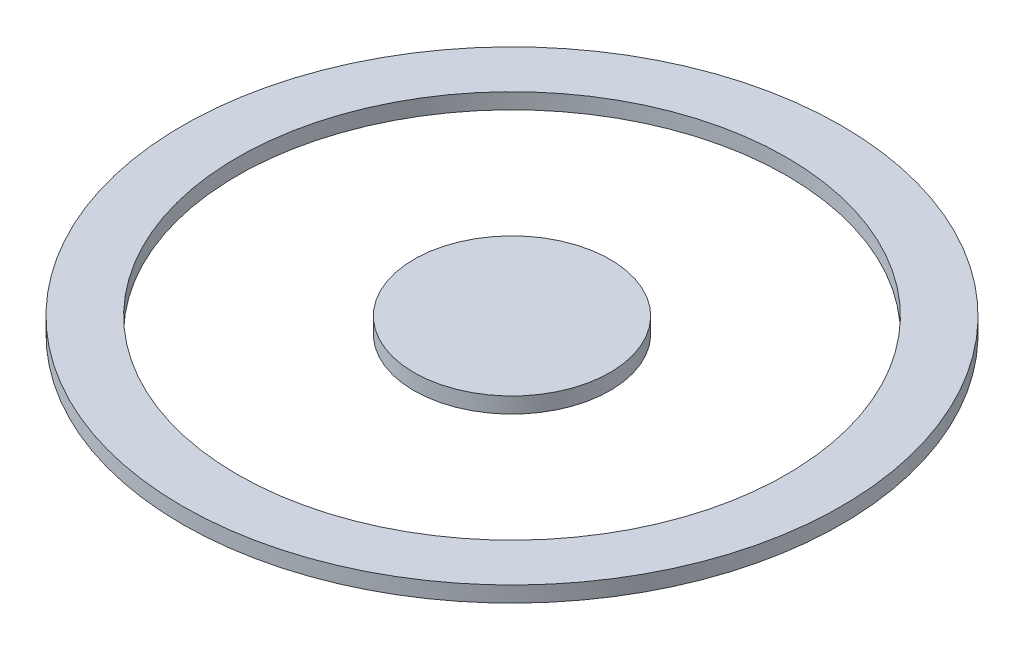
ISO-10303-21;
HEADER;
FILE_DESCRIPTION(('STEP AP214'),'2;1');
FILE_NAME('part.step','',(''),(''),'','','');
FILE_SCHEMA(('AUTOMOTIVE_DESIGN { 1 0 10303 214 1 1 1 1 }'));
ENDSEC;
DATA;
#1=APPLICATION_CONTEXT('core data for automotive mechanical design processes');
#2=APPLICATION_PROTOCOL_DEFINITION('international standard','automotive_design',2000,#1);
#3=PRODUCT_CONTEXT('',#1,'mechanical');
#4=PRODUCT('Part','Part','',(#3));
#5=PRODUCT_RELATED_PRODUCT_CATEGORY('part','',(#4));
#6=PRODUCT_DEFINITION_FORMATION('','',#4);
#7=PRODUCT_DEFINITION_CONTEXT('part definition',#1,'design');
#8=PRODUCT_DEFINITION('design','',#6,#7);
#9=PRODUCT_DEFINITION_SHAPE('','',#8);
#10=(LENGTH_UNIT() NAMED_UNIT(*) SI_UNIT(.MILLI.,.METRE.));
#11=(NAMED_UNIT(*) PLANE_ANGLE_UNIT() SI_UNIT($,.RADIAN.));
#12=(NAMED_UNIT(*) SI_UNIT($,.STERADIAN.) SOLID_ANGLE_UNIT());
#13=UNCERTAINTY_MEASURE_WITH_UNIT(LENGTH_MEASURE(1.E-05),#10,'distance_accuracy_value','');
#14=(GEOMETRIC_REPRESENTATION_CONTEXT(3) GLOBAL_UNCERTAINTY_ASSIGNED_CONTEXT((#13)) GLOBAL_UNIT_ASSIGNED_CONTEXT((#10,
#11,#12)) REPRESENTATION_CONTEXT('',''));
#15=CARTESIAN_POINT('',(0.,0.,0.));
#16=DIRECTION('',(0.,0.,1.));
#17=DIRECTION('',(1.,0.,0.));
#18=AXIS2_PLACEMENT_3D('',#15,#16,#17);
#19=CARTESIAN_POINT('',(0.,2.,0.));
#20=DIRECTION('',(0.,-1.,0.));
#21=DIRECTION('',(0.,0.,-1.));
#22=AXIS2_PLACEMENT_3D('',#19,#20,#21);
#23=CYLINDRICAL_SURFACE('',#22,42.);
#24=CARTESIAN_POINT('',(0.,2.,0.));
#25=DIRECTION('',(0.,1.,0.));
#26=DIRECTION('',(0.,0.,1.));
#27=AXIS2_PLACEMENT_3D('',#24,#25,#26);
#28=CIRCLE('',#27,42.);
#29=CARTESIAN_POINT('',(0.,2.,42.));
#30=VERTEX_POINT('',#29);
#31=EDGE_CURVE('E55',#30,#30,#28,.T.);
#32=ORIENTED_EDGE('',*,*,#31,.F.);
#33=EDGE_LOOP('',(#32));
#34=FACE_BOUND('',#33,.T.);
#35=CARTESIAN_POINT('',(0.,0.,0.));
#36=DIRECTION('',(0.,1.,0.));
#37=DIRECTION('',(0.,0.,1.));
#38=AXIS2_PLACEMENT_3D('',#35,#36,#37);
#39=CIRCLE('',#38,42.);
#40=CARTESIAN_POINT('',(0.,0.,42.));
#41=VERTEX_POINT('',#40);
#42=EDGE_CURVE('E59',#41,#41,#39,.T.);
#43=ORIENTED_EDGE('',*,*,#42,.T.);
#44=EDGE_LOOP('',(#43));
#45=FACE_BOUND('',#44,.T.);
#46=ADVANCED_FACE('F44',(#34,#45),#23,.T.);
#47=CARTESIAN_POINT('',(0.,2.,0.));
#48=DIRECTION('',(0.,1.,0.));
#49=DIRECTION('',(0.,0.,1.));
#50=AXIS2_PLACEMENT_3D('',#47,#48,#49);
#51=PLANE('',#50);
#52=CARTESIAN_POINT('',(0.,2.,0.));
#53=DIRECTION('',(0.,1.,0.));
#54=DIRECTION('',(0.,0.,1.));
#55=AXIS2_PLACEMENT_3D('',#52,#53,#54);
#56=CIRCLE('',#55,35.);
#57=CARTESIAN_POINT('',(0.,2.,35.));
#58=VERTEX_POINT('',#57);
#59=EDGE_CURVE('E11',#58,#58,#56,.T.);
#60=ORIENTED_EDGE('',*,*,#59,.F.);
#61=EDGE_LOOP('',(#60));
#62=FACE_BOUND('',#61,.T.);
#63=ORIENTED_EDGE('',*,*,#31,.T.);
#64=EDGE_LOOP('',(#63));
#65=FACE_BOUND('',#64,.T.);
#66=ADVANCED_FACE('F46',(#62,#65),#51,.T.);
#67=CARTESIAN_POINT('',(0.,0.,0.));
#68=DIRECTION('',(0.,1.,0.));
#69=DIRECTION('',(0.,0.,1.));
#70=AXIS2_PLACEMENT_3D('',#67,#68,#69);
#71=PLANE('',#70);
#72=CARTESIAN_POINT('',(0.,0.,0.));
#73=DIRECTION('',(0.,1.,0.));
#74=DIRECTION('',(0.,0.,1.));
#75=AXIS2_PLACEMENT_3D('',#72,#73,#74);
#76=CIRCLE('',#75,35.);
#77=CARTESIAN_POINT('',(0.,0.,35.));
#78=VERTEX_POINT('',#77);
#79=EDGE_CURVE('E48',#78,#78,#76,.T.);
#80=ORIENTED_EDGE('',*,*,#79,.T.);
#81=EDGE_LOOP('',(#80));
#82=FACE_BOUND('',#81,.T.);
#83=ORIENTED_EDGE('',*,*,#42,.F.);
#84=EDGE_LOOP('',(#83));
#85=FACE_BOUND('',#84,.T.);
#86=ADVANCED_FACE('F64',(#82,#85),#71,.F.);
#87=CARTESIAN_POINT('',(0.,0.,0.));
#88=DIRECTION('',(0.,1.,0.));
#89=DIRECTION('',(0.,0.,1.));
#90=AXIS2_PLACEMENT_3D('',#87,#88,#89);
#91=CYLINDRICAL_SURFACE('',#90,35.);
#92=ORIENTED_EDGE('',*,*,#79,.F.);
#93=EDGE_LOOP('',(#92));
#94=FACE_BOUND('',#93,.T.);
#95=ORIENTED_EDGE('',*,*,#59,.T.);
#96=EDGE_LOOP('',(#95));
#97=FACE_BOUND('',#96,.T.);
#98=ADVANCED_FACE('F66',(#94,#97),#91,.F.);
#99=CLOSED_SHELL('',(#46,#66,#86,#98));
#100=MANIFOLD_SOLID_BREP('B2',#99);
#101=CARTESIAN_POINT('',(0.,0.,0.));
#102=DIRECTION('',(0.,1.,0.));
#103=DIRECTION('',(0.,0.,1.));
#104=AXIS2_PLACEMENT_3D('',#101,#102,#103);
#105=PLANE('',#104);
#106=CARTESIAN_POINT('',(0.,0.,0.));
#107=DIRECTION('',(0.,1.,0.));
#108=DIRECTION('',(0.,0.,1.));
#109=AXIS2_PLACEMENT_3D('',#106,#107,#108);
#110=CIRCLE('',#109,12.5);
#111=CARTESIAN_POINT('',(0.,0.,12.5));
#112=VERTEX_POINT('',#111);
#113=EDGE_CURVE('E43',#112,#112,#110,.T.);
#114=ORIENTED_EDGE('',*,*,#113,.F.);
#115=EDGE_LOOP('',(#114));
#116=FACE_BOUND('',#115,.T.);
#117=ADVANCED_FACE('F113',(#116),#105,.F.);
#118=CARTESIAN_POINT('',(0.,0.,0.));
#119=DIRECTION('',(0.,1.,0.));
#120=DIRECTION('',(0.,0.,1.));
#121=AXIS2_PLACEMENT_3D('',#118,#119,#120);
#122=CYLINDRICAL_SURFACE('',#121,12.5);
#123=ORIENTED_EDGE('',*,*,#113,.T.);
#124=EDGE_LOOP('',(#123));
#125=FACE_BOUND('',#124,.T.);
#126=CARTESIAN_POINT('',(0.,2.,0.));
#127=DIRECTION('',(0.,1.,0.));
#128=DIRECTION('',(0.,0.,1.));
#129=AXIS2_PLACEMENT_3D('',#126,#127,#128);
#130=CIRCLE('',#129,12.5);
#131=CARTESIAN_POINT('',(0.,2.,12.5));
#132=VERTEX_POINT('',#131);
#133=EDGE_CURVE('E116',#132,#132,#130,.T.);
#134=ORIENTED_EDGE('',*,*,#133,.F.);
#135=EDGE_LOOP('',(#134));
#136=FACE_BOUND('',#135,.T.);
#137=ADVANCED_FACE('F127',(#125,#136),#122,.T.);
#138=CARTESIAN_POINT('',(0.,2.,0.));
#139=DIRECTION('',(0.,1.,0.));
#140=DIRECTION('',(0.,0.,1.));
#141=AXIS2_PLACEMENT_3D('',#138,#139,#140);
#142=PLANE('',#141);
#143=ORIENTED_EDGE('',*,*,#133,.T.);
#144=EDGE_LOOP('',(#143));
#145=FACE_BOUND('',#144,.T.);
#146=ADVANCED_FACE('F125',(#145),#142,.T.);
#147=CLOSED_SHELL('',(#117,#137,#146));
#148=MANIFOLD_SOLID_BREP('B6',#147);
#149=ADVANCED_BREP_SHAPE_REPRESENTATION('',(#18,#100,#148),#14);
#150=SHAPE_DEFINITION_REPRESENTATION(#9,#149);
ENDSEC;
END-ISO-10303-21;
